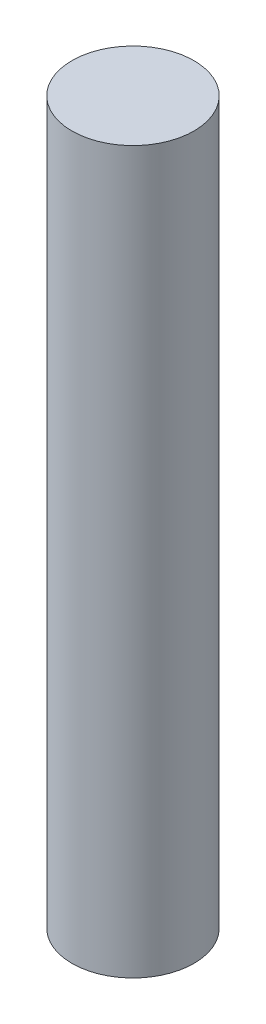
ISO-10303-21;
HEADER;
FILE_DESCRIPTION(('STEP AP214'),'2;1');
FILE_NAME('part.step','',(''),(''),'','','');
FILE_SCHEMA(('AUTOMOTIVE_DESIGN { 1 0 10303 214 1 1 1 1 }'));
ENDSEC;
DATA;
#1=APPLICATION_CONTEXT('core data for automotive mechanical design processes');
#2=APPLICATION_PROTOCOL_DEFINITION('international standard','automotive_design',2000,#1);
#3=PRODUCT_CONTEXT('',#1,'mechanical');
#4=PRODUCT('Part','Part','',(#3));
#5=PRODUCT_RELATED_PRODUCT_CATEGORY('part','',(#4));
#6=PRODUCT_DEFINITION_FORMATION('','',#4);
#7=PRODUCT_DEFINITION_CONTEXT('part definition',#1,'design');
#8=PRODUCT_DEFINITION('design','',#6,#7);
#9=PRODUCT_DEFINITION_SHAPE('','',#8);
#10=(LENGTH_UNIT() NAMED_UNIT(*) SI_UNIT(.MILLI.,.METRE.));
#11=(NAMED_UNIT(*) PLANE_ANGLE_UNIT() SI_UNIT($,.RADIAN.));
#12=(NAMED_UNIT(*) SI_UNIT($,.STERADIAN.) SOLID_ANGLE_UNIT());
#13=UNCERTAINTY_MEASURE_WITH_UNIT(LENGTH_MEASURE(1.E-05),#10,'distance_accuracy_value','');
#14=(GEOMETRIC_REPRESENTATION_CONTEXT(3) GLOBAL_UNCERTAINTY_ASSIGNED_CONTEXT((#13)) GLOBAL_UNIT_ASSIGNED_CONTEXT((#10,
#11,#12)) REPRESENTATION_CONTEXT('',''));
#15=CARTESIAN_POINT('',(0.,0.,0.));
#16=DIRECTION('',(0.,0.,1.));
#17=DIRECTION('',(1.,0.,0.));
#18=AXIS2_PLACEMENT_3D('',#15,#16,#17);
#19=CARTESIAN_POINT('',(0.,13.,0.));
#20=DIRECTION('',(0.,-1.,0.));
#21=DIRECTION('',(0.,0.,-1.));
#22=AXIS2_PLACEMENT_3D('',#19,#20,#21);
#23=CYLINDRICAL_SURFACE('',#22,1.1);
#24=CARTESIAN_POINT('',(0.,13.,0.));
#25=DIRECTION('',(0.,1.,0.));
#26=DIRECTION('',(0.,0.,1.));
#27=AXIS2_PLACEMENT_3D('',#24,#25,#26);
#28=CIRCLE('',#27,1.1);
#29=CARTESIAN_POINT('',(0.,13.,1.1));
#30=VERTEX_POINT('',#29);
#31=EDGE_CURVE('E10',#30,#30,#28,.T.);
#32=ORIENTED_EDGE('',*,*,#31,.F.);
#33=EDGE_LOOP('',(#32));
#34=FACE_BOUND('',#33,.T.);
#35=CARTESIAN_POINT('',(0.,0.,0.));
#36=DIRECTION('',(0.,1.,0.));
#37=DIRECTION('',(0.,0.,1.));
#38=AXIS2_PLACEMENT_3D('',#35,#36,#37);
#39=CIRCLE('',#38,1.1);
#40=CARTESIAN_POINT('',(0.,0.,1.1));
#41=VERTEX_POINT('',#40);
#42=EDGE_CURVE('E40',#41,#41,#39,.T.);
#43=ORIENTED_EDGE('',*,*,#42,.T.);
#44=EDGE_LOOP('',(#43));
#45=FACE_BOUND('',#44,.T.);
#46=ADVANCED_FACE('F37',(#34,#45),#23,.T.);
#47=CARTESIAN_POINT('',(0.,13.,0.));
#48=DIRECTION('',(0.,1.,0.));
#49=DIRECTION('',(0.,0.,1.));
#50=AXIS2_PLACEMENT_3D('',#47,#48,#49);
#51=PLANE('',#50);
#52=ORIENTED_EDGE('',*,*,#31,.T.);
#53=EDGE_LOOP('',(#52));
#54=FACE_BOUND('',#53,.T.);
#55=ADVANCED_FACE('F52',(#54),#51,.T.);
#56=CARTESIAN_POINT('',(0.,0.,0.));
#57=DIRECTION('',(0.,1.,0.));
#58=DIRECTION('',(0.,0.,1.));
#59=AXIS2_PLACEMENT_3D('',#56,#57,#58);
#60=PLANE('',#59);
#61=ORIENTED_EDGE('',*,*,#42,.F.);
#62=EDGE_LOOP('',(#61));
#63=FACE_BOUND('',#62,.T.);
#64=ADVANCED_FACE('F50',(#63),#60,.F.);
#65=CLOSED_SHELL('',(#46,#55,#64));
#66=MANIFOLD_SOLID_BREP('B2',#65);
#67=ADVANCED_BREP_SHAPE_REPRESENTATION('',(#18,#66),#14);
#68=SHAPE_DEFINITION_REPRESENTATION(#9,#67);
ENDSEC;
END-ISO-10303-21;
